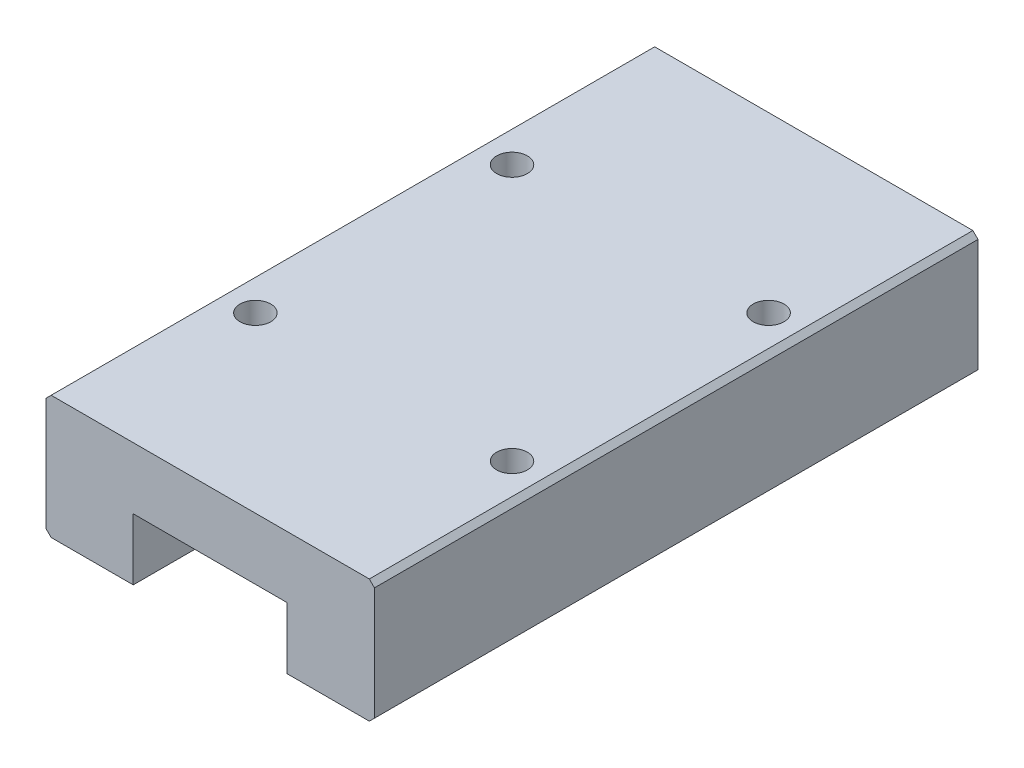
ISO-10303-21;
HEADER;
FILE_DESCRIPTION(('STEP AP214'),'2;1');
FILE_NAME('part.step','',(''),(''),'','','');
FILE_SCHEMA(('AUTOMOTIVE_DESIGN { 1 0 10303 214 1 1 1 1 }'));
ENDSEC;
DATA;
#1=APPLICATION_CONTEXT('core data for automotive mechanical design processes');
#2=APPLICATION_PROTOCOL_DEFINITION('international standard','automotive_design',2000,#1);
#3=PRODUCT_CONTEXT('',#1,'mechanical');
#4=PRODUCT('Part','Part','',(#3));
#5=PRODUCT_RELATED_PRODUCT_CATEGORY('part','',(#4));
#6=PRODUCT_DEFINITION_FORMATION('','',#4);
#7=PRODUCT_DEFINITION_CONTEXT('part definition',#1,'design');
#8=PRODUCT_DEFINITION('design','',#6,#7);
#9=PRODUCT_DEFINITION_SHAPE('','',#8);
#10=(LENGTH_UNIT() NAMED_UNIT(*) SI_UNIT(.MILLI.,.METRE.));
#11=(NAMED_UNIT(*) PLANE_ANGLE_UNIT() SI_UNIT($,.RADIAN.));
#12=(NAMED_UNIT(*) SI_UNIT($,.STERADIAN.) SOLID_ANGLE_UNIT());
#13=UNCERTAINTY_MEASURE_WITH_UNIT(LENGTH_MEASURE(1.E-05),#10,'distance_accuracy_value','');
#14=(GEOMETRIC_REPRESENTATION_CONTEXT(3) GLOBAL_UNCERTAINTY_ASSIGNED_CONTEXT((#13)) GLOBAL_UNIT_ASSIGNED_CONTEXT((#10,
#11,#12)) REPRESENTATION_CONTEXT('',''));
#15=CARTESIAN_POINT('',(0.,0.,0.));
#16=DIRECTION('',(0.,0.,1.));
#17=DIRECTION('',(1.,0.,0.));
#18=AXIS2_PLACEMENT_3D('',#15,#16,#17);
#19=CARTESIAN_POINT('',(-12.7323943661972,9.97887323943662,58.8));
#20=DIRECTION('',(0.707106781186547,-0.707106781186547,0.));
#21=DIRECTION('',(0.707106781186548,0.707106781186548,0.));
#22=AXIS2_PLACEMENT_3D('',#19,#20,#21);
#23=PLANE('',#22);
#24=DIRECTION('',(-0.707106781186547,-0.707106781186547,0.));
#25=VECTOR('',#24,1.);
#26=CARTESIAN_POINT('',(-12.7323943661972,9.97887323943662,0.));
#27=LINE('',#26,#25);
#28=CARTESIAN_POINT('',(-12.2323943661972,10.4788732394366,0.));
#29=VERTEX_POINT('',#28);
#30=CARTESIAN_POINT('',(-12.7323943661972,9.97887323943662,0.));
#31=VERTEX_POINT('',#30);
#32=EDGE_CURVE('E155',#29,#31,#27,.T.);
#33=ORIENTED_EDGE('',*,*,#32,.T.);
#34=DIRECTION('',(0.,0.,-1.));
#35=VECTOR('',#34,1.);
#36=CARTESIAN_POINT('',(-12.7323943661972,9.97887323943662,58.8));
#37=LINE('',#36,#35);
#38=CARTESIAN_POINT('',(-12.7323943661972,9.97887323943662,58.8));
#39=VERTEX_POINT('',#38);
#40=EDGE_CURVE('E11',#39,#31,#37,.T.);
#41=ORIENTED_EDGE('',*,*,#40,.F.);
#42=DIRECTION('',(-0.707106781186547,-0.707106781186547,0.));
#43=VECTOR('',#42,1.);
#44=CARTESIAN_POINT('',(-12.7323943661972,9.97887323943662,58.8));
#45=LINE('',#44,#43);
#46=CARTESIAN_POINT('',(-12.2323943661972,10.4788732394366,58.8));
#47=VERTEX_POINT('',#46);
#48=EDGE_CURVE('E178',#47,#39,#45,.T.);
#49=ORIENTED_EDGE('',*,*,#48,.F.);
#50=DIRECTION('',(0.,0.,-1.));
#51=VECTOR('',#50,1.);
#52=CARTESIAN_POINT('',(-12.2323943661972,10.4788732394366,58.8));
#53=LINE('',#52,#51);
#54=EDGE_CURVE('E151',#47,#29,#53,.T.);
#55=ORIENTED_EDGE('',*,*,#54,.T.);
#56=EDGE_LOOP('',(#33,#41,#49,#55));
#57=FACE_BOUND('',#56,.T.);
#58=ADVANCED_FACE('F35',(#57),#23,.F.);
#59=CARTESIAN_POINT('',(-12.7323943661972,9.97887323943662,58.8));
#60=DIRECTION('',(1.,0.,0.));
#61=DIRECTION('',(0.,1.,0.));
#62=AXIS2_PLACEMENT_3D('',#59,#60,#61);
#63=PLANE('',#62);
#64=DIRECTION('',(0.,-1.,0.));
#65=VECTOR('',#64,1.);
#66=CARTESIAN_POINT('',(-12.7323943661972,9.97887323943662,0.));
#67=LINE('',#66,#65);
#68=CARTESIAN_POINT('',(-12.7323943661972,-1.02112676056338,0.));
#69=VERTEX_POINT('',#68);
#70=EDGE_CURVE('E158',#31,#69,#67,.T.);
#71=ORIENTED_EDGE('',*,*,#70,.T.);
#72=DIRECTION('',(0.,0.,-1.));
#73=VECTOR('',#72,1.);
#74=CARTESIAN_POINT('',(-12.7323943661972,-1.02112676056338,58.8));
#75=LINE('',#74,#73);
#76=CARTESIAN_POINT('',(-12.7323943661972,-1.02112676056338,58.8));
#77=VERTEX_POINT('',#76);
#78=EDGE_CURVE('E43',#77,#69,#75,.T.);
#79=ORIENTED_EDGE('',*,*,#78,.F.);
#80=DIRECTION('',(0.,-1.,0.));
#81=VECTOR('',#80,1.);
#82=CARTESIAN_POINT('',(-12.7323943661972,9.97887323943662,58.8));
#83=LINE('',#82,#81);
#84=EDGE_CURVE('E106',#39,#77,#83,.T.);
#85=ORIENTED_EDGE('',*,*,#84,.F.);
#86=ORIENTED_EDGE('',*,*,#40,.T.);
#87=EDGE_LOOP('',(#71,#79,#85,#86));
#88=FACE_BOUND('',#87,.T.);
#89=ADVANCED_FACE('F259',(#88),#63,.F.);
#90=CARTESIAN_POINT('',(-12.7323943661972,-1.02112676056338,58.8));
#91=DIRECTION('',(0.707106781186547,0.707106781186548,0.));
#92=DIRECTION('',(-0.707106781186548,0.707106781186547,0.));
#93=AXIS2_PLACEMENT_3D('',#90,#91,#92);
#94=PLANE('',#93);
#95=DIRECTION('',(0.707106781186548,-0.707106781186547,0.));
#96=VECTOR('',#95,1.);
#97=CARTESIAN_POINT('',(-12.7323943661972,-1.02112676056338,0.));
#98=LINE('',#97,#96);
#99=CARTESIAN_POINT('',(-12.2323943661972,-1.52112676056338,0.));
#100=VERTEX_POINT('',#99);
#101=EDGE_CURVE('E161',#69,#100,#98,.T.);
#102=ORIENTED_EDGE('',*,*,#101,.T.);
#103=DIRECTION('',(0.,0.,-1.));
#104=VECTOR('',#103,1.);
#105=CARTESIAN_POINT('',(-12.2323943661972,-1.52112676056338,58.8));
#106=LINE('',#105,#104);
#107=CARTESIAN_POINT('',(-12.2323943661972,-1.52112676056338,58.8));
#108=VERTEX_POINT('',#107);
#109=EDGE_CURVE('E197',#108,#100,#106,.T.);
#110=ORIENTED_EDGE('',*,*,#109,.F.);
#111=DIRECTION('',(0.707106781186548,-0.707106781186547,0.));
#112=VECTOR('',#111,1.);
#113=CARTESIAN_POINT('',(-12.7323943661972,-1.02112676056338,58.8));
#114=LINE('',#113,#112);
#115=EDGE_CURVE('E205',#77,#108,#114,.T.);
#116=ORIENTED_EDGE('',*,*,#115,.F.);
#117=ORIENTED_EDGE('',*,*,#78,.T.);
#118=EDGE_LOOP('',(#102,#110,#116,#117));
#119=FACE_BOUND('',#118,.T.);
#120=ADVANCED_FACE('F203',(#119),#94,.F.);
#121=CARTESIAN_POINT('',(-12.2323943661972,-1.52112676056338,58.8));
#122=DIRECTION('',(0.,1.,0.));
#123=DIRECTION('',(0.,0.,1.));
#124=AXIS2_PLACEMENT_3D('',#121,#122,#123);
#125=PLANE('',#124);
#126=DIRECTION('',(1.,0.,0.));
#127=VECTOR('',#126,1.);
#128=CARTESIAN_POINT('',(-12.2323943661972,-1.52112676056338,0.));
#129=LINE('',#128,#127);
#130=CARTESIAN_POINT('',(-4.23239436619719,-1.52112676056338,0.));
#131=VERTEX_POINT('',#130);
#132=EDGE_CURVE('E163',#100,#131,#129,.T.);
#133=ORIENTED_EDGE('',*,*,#132,.T.);
#134=DIRECTION('',(0.,0.,-1.));
#135=VECTOR('',#134,1.);
#136=CARTESIAN_POINT('',(-4.23239436619719,-1.52112676056338,58.8));
#137=LINE('',#136,#135);
#138=CARTESIAN_POINT('',(-4.23239436619719,-1.52112676056338,58.8));
#139=VERTEX_POINT('',#138);
#140=EDGE_CURVE('E194',#139,#131,#137,.T.);
#141=ORIENTED_EDGE('',*,*,#140,.F.);
#142=DIRECTION('',(1.,0.,0.));
#143=VECTOR('',#142,1.);
#144=CARTESIAN_POINT('',(-12.2323943661972,-1.52112676056338,58.8));
#145=LINE('',#144,#143);
#146=EDGE_CURVE('E223',#108,#139,#145,.T.);
#147=ORIENTED_EDGE('',*,*,#146,.F.);
#148=ORIENTED_EDGE('',*,*,#109,.T.);
#149=EDGE_LOOP('',(#133,#141,#147,#148));
#150=FACE_BOUND('',#149,.T.);
#151=ADVANCED_FACE('F214',(#150),#125,.F.);
#152=CARTESIAN_POINT('',(-4.23239436619719,-1.52112676056338,58.8));
#153=DIRECTION('',(-1.,0.,0.));
#154=DIRECTION('',(0.,-1.,0.));
#155=AXIS2_PLACEMENT_3D('',#152,#153,#154);
#156=PLANE('',#155);
#157=DIRECTION('',(0.,1.,0.));
#158=VECTOR('',#157,1.);
#159=CARTESIAN_POINT('',(-4.23239436619719,-1.52112676056338,0.));
#160=LINE('',#159,#158);
#161=CARTESIAN_POINT('',(-4.23239436619719,4.47887323943662,0.));
#162=VERTEX_POINT('',#161);
#163=EDGE_CURVE('E165',#131,#162,#160,.T.);
#164=ORIENTED_EDGE('',*,*,#163,.T.);
#165=DIRECTION('',(0.,0.,-1.));
#166=VECTOR('',#165,1.);
#167=CARTESIAN_POINT('',(-4.23239436619719,4.47887323943662,58.8));
#168=LINE('',#167,#166);
#169=CARTESIAN_POINT('',(-4.23239436619719,4.47887323943662,58.8));
#170=VERTEX_POINT('',#169);
#171=EDGE_CURVE('E191',#170,#162,#168,.T.);
#172=ORIENTED_EDGE('',*,*,#171,.F.);
#173=DIRECTION('',(0.,1.,0.));
#174=VECTOR('',#173,1.);
#175=CARTESIAN_POINT('',(-4.23239436619719,-1.52112676056338,58.8));
#176=LINE('',#175,#174);
#177=EDGE_CURVE('E220',#139,#170,#176,.T.);
#178=ORIENTED_EDGE('',*,*,#177,.F.);
#179=ORIENTED_EDGE('',*,*,#140,.T.);
#180=EDGE_LOOP('',(#164,#172,#178,#179));
#181=FACE_BOUND('',#180,.T.);
#182=ADVANCED_FACE('F218',(#181),#156,.F.);
#183=CARTESIAN_POINT('',(-4.23239436619719,4.47887323943662,58.8));
#184=DIRECTION('',(0.,1.,0.));
#185=DIRECTION('',(-1.,0.,0.));
#186=AXIS2_PLACEMENT_3D('',#183,#184,#185);
#187=PLANE('',#186);
#188=DIRECTION('',(1.,0.,0.));
#189=VECTOR('',#188,1.);
#190=CARTESIAN_POINT('',(-4.23239436619719,4.47887323943662,0.));
#191=LINE('',#190,#189);
#192=CARTESIAN_POINT('',(10.7676056338028,4.47887323943662,0.));
#193=VERTEX_POINT('',#192);
#194=EDGE_CURVE('E167',#162,#193,#191,.T.);
#195=ORIENTED_EDGE('',*,*,#194,.T.);
#196=DIRECTION('',(0.,0.,-1.));
#197=VECTOR('',#196,1.);
#198=CARTESIAN_POINT('',(10.7676056338028,4.47887323943662,58.8));
#199=LINE('',#198,#197);
#200=CARTESIAN_POINT('',(10.7676056338028,4.47887323943662,58.8));
#201=VERTEX_POINT('',#200);
#202=EDGE_CURVE('E188',#201,#193,#199,.T.);
#203=ORIENTED_EDGE('',*,*,#202,.F.);
#204=DIRECTION('',(1.,0.,0.));
#205=VECTOR('',#204,1.);
#206=CARTESIAN_POINT('',(-4.23239436619719,4.47887323943662,58.8));
#207=LINE('',#206,#205);
#208=EDGE_CURVE('E222',#170,#201,#207,.T.);
#209=ORIENTED_EDGE('',*,*,#208,.F.);
#210=ORIENTED_EDGE('',*,*,#171,.T.);
#211=EDGE_LOOP('',(#195,#203,#209,#210));
#212=FACE_BOUND('',#211,.T.);
#213=ADVANCED_FACE('F272',(#212),#187,.F.);
#214=CARTESIAN_POINT('',(10.7676056338028,-1.52112676056338,58.8));
#215=DIRECTION('',(1.,0.,0.));
#216=DIRECTION('',(0.,1.,0.));
#217=AXIS2_PLACEMENT_3D('',#214,#215,#216);
#218=PLANE('',#217);
#219=DIRECTION('',(0.,-1.,0.));
#220=VECTOR('',#219,1.);
#221=CARTESIAN_POINT('',(10.7676056338028,-1.52112676056338,0.));
#222=LINE('',#221,#220);
#223=CARTESIAN_POINT('',(10.7676056338028,-1.52112676056338,0.));
#224=VERTEX_POINT('',#223);
#225=EDGE_CURVE('E169',#193,#224,#222,.T.);
#226=ORIENTED_EDGE('',*,*,#225,.T.);
#227=DIRECTION('',(0.,0.,-1.));
#228=VECTOR('',#227,1.);
#229=CARTESIAN_POINT('',(10.7676056338028,-1.52112676056338,58.8));
#230=LINE('',#229,#228);
#231=CARTESIAN_POINT('',(10.7676056338028,-1.52112676056338,58.8));
#232=VERTEX_POINT('',#231);
#233=EDGE_CURVE('E185',#232,#224,#230,.T.);
#234=ORIENTED_EDGE('',*,*,#233,.F.);
#235=DIRECTION('',(0.,-1.,0.));
#236=VECTOR('',#235,1.);
#237=CARTESIAN_POINT('',(10.7676056338028,-1.52112676056338,58.8));
#238=LINE('',#237,#236);
#239=EDGE_CURVE('E225',#201,#232,#238,.T.);
#240=ORIENTED_EDGE('',*,*,#239,.F.);
#241=ORIENTED_EDGE('',*,*,#202,.T.);
#242=EDGE_LOOP('',(#226,#234,#240,#241));
#243=FACE_BOUND('',#242,.T.);
#244=ADVANCED_FACE('F275',(#243),#218,.F.);
#245=CARTESIAN_POINT('',(10.7676056338028,-1.52112676056338,58.8));
#246=DIRECTION('',(0.,1.,0.));
#247=DIRECTION('',(0.,0.,1.));
#248=AXIS2_PLACEMENT_3D('',#245,#246,#247);
#249=PLANE('',#248);
#250=DIRECTION('',(1.,0.,0.));
#251=VECTOR('',#250,1.);
#252=CARTESIAN_POINT('',(10.7676056338028,-1.52112676056338,0.));
#253=LINE('',#252,#251);
#254=CARTESIAN_POINT('',(18.7676056338028,-1.52112676056338,0.));
#255=VERTEX_POINT('',#254);
#256=EDGE_CURVE('E171',#224,#255,#253,.T.);
#257=ORIENTED_EDGE('',*,*,#256,.T.);
#258=DIRECTION('',(0.,0.,-1.));
#259=VECTOR('',#258,1.);
#260=CARTESIAN_POINT('',(18.7676056338028,-1.52112676056338,58.8));
#261=LINE('',#260,#259);
#262=CARTESIAN_POINT('',(18.7676056338028,-1.52112676056338,58.8));
#263=VERTEX_POINT('',#262);
#264=EDGE_CURVE('E182',#263,#255,#261,.T.);
#265=ORIENTED_EDGE('',*,*,#264,.F.);
#266=DIRECTION('',(1.,0.,0.));
#267=VECTOR('',#266,1.);
#268=CARTESIAN_POINT('',(10.7676056338028,-1.52112676056338,58.8));
#269=LINE('',#268,#267);
#270=EDGE_CURVE('E231',#232,#263,#269,.T.);
#271=ORIENTED_EDGE('',*,*,#270,.F.);
#272=ORIENTED_EDGE('',*,*,#233,.T.);
#273=EDGE_LOOP('',(#257,#265,#271,#272));
#274=FACE_BOUND('',#273,.T.);
#275=ADVANCED_FACE('F237',(#274),#249,.F.);
#276=CARTESIAN_POINT('',(19.2676056338028,-1.02112676056338,58.8));
#277=DIRECTION('',(-0.707106781186547,0.707106781186548,0.));
#278=DIRECTION('',(-0.707106781186548,-0.707106781186547,0.));
#279=AXIS2_PLACEMENT_3D('',#276,#277,#278);
#280=PLANE('',#279);
#281=DIRECTION('',(0.707106781186548,0.707106781186547,0.));
#282=VECTOR('',#281,1.);
#283=CARTESIAN_POINT('',(19.2676056338028,-1.02112676056338,0.));
#284=LINE('',#283,#282);
#285=CARTESIAN_POINT('',(19.2676056338028,-1.02112676056338,0.));
#286=VERTEX_POINT('',#285);
#287=EDGE_CURVE('E173',#255,#286,#284,.T.);
#288=ORIENTED_EDGE('',*,*,#287,.T.);
#289=DIRECTION('',(0.,0.,-1.));
#290=VECTOR('',#289,1.);
#291=CARTESIAN_POINT('',(19.2676056338028,-1.02112676056338,58.8));
#292=LINE('',#291,#290);
#293=CARTESIAN_POINT('',(19.2676056338028,-1.02112676056338,58.8));
#294=VERTEX_POINT('',#293);
#295=EDGE_CURVE('E146',#294,#286,#292,.T.);
#296=ORIENTED_EDGE('',*,*,#295,.F.);
#297=DIRECTION('',(0.707106781186548,0.707106781186547,0.));
#298=VECTOR('',#297,1.);
#299=CARTESIAN_POINT('',(19.2676056338028,-1.02112676056338,58.8));
#300=LINE('',#299,#298);
#301=EDGE_CURVE('E137',#263,#294,#300,.T.);
#302=ORIENTED_EDGE('',*,*,#301,.F.);
#303=ORIENTED_EDGE('',*,*,#264,.T.);
#304=EDGE_LOOP('',(#288,#296,#302,#303));
#305=FACE_BOUND('',#304,.T.);
#306=ADVANCED_FACE('F241',(#305),#280,.F.);
#307=CARTESIAN_POINT('',(19.2676056338028,9.97887323943662,58.8));
#308=DIRECTION('',(-1.,0.,0.));
#309=DIRECTION('',(0.,-1.,0.));
#310=AXIS2_PLACEMENT_3D('',#307,#308,#309);
#311=PLANE('',#310);
#312=DIRECTION('',(0.,1.,0.));
#313=VECTOR('',#312,1.);
#314=CARTESIAN_POINT('',(19.2676056338028,9.97887323943662,0.));
#315=LINE('',#314,#313);
#316=CARTESIAN_POINT('',(19.2676056338028,9.97887323943662,0.));
#317=VERTEX_POINT('',#316);
#318=EDGE_CURVE('E145',#286,#317,#315,.T.);
#319=ORIENTED_EDGE('',*,*,#318,.T.);
#320=DIRECTION('',(0.,0.,-1.));
#321=VECTOR('',#320,1.);
#322=CARTESIAN_POINT('',(19.2676056338028,9.97887323943662,58.8));
#323=LINE('',#322,#321);
#324=CARTESIAN_POINT('',(19.2676056338028,9.97887323943662,58.8));
#325=VERTEX_POINT('',#324);
#326=EDGE_CURVE('E142',#325,#317,#323,.T.);
#327=ORIENTED_EDGE('',*,*,#326,.F.);
#328=DIRECTION('',(0.,1.,0.));
#329=VECTOR('',#328,1.);
#330=CARTESIAN_POINT('',(19.2676056338028,9.97887323943662,58.8));
#331=LINE('',#330,#329);
#332=EDGE_CURVE('E131',#294,#325,#331,.T.);
#333=ORIENTED_EDGE('',*,*,#332,.F.);
#334=ORIENTED_EDGE('',*,*,#295,.T.);
#335=EDGE_LOOP('',(#319,#327,#333,#334));
#336=FACE_BOUND('',#335,.T.);
#337=ADVANCED_FACE('F143',(#336),#311,.F.);
#338=CARTESIAN_POINT('',(18.7676056338028,10.4788732394366,58.8));
#339=DIRECTION('',(-0.707106781186547,-0.707106781186547,0.));
#340=DIRECTION('',(0.707106781186548,-0.707106781186548,0.));
#341=AXIS2_PLACEMENT_3D('',#338,#339,#340);
#342=PLANE('',#341);
#343=DIRECTION('',(-0.707106781186547,0.707106781186547,0.));
#344=VECTOR('',#343,1.);
#345=CARTESIAN_POINT('',(18.7676056338028,10.4788732394366,0.));
#346=LINE('',#345,#344);
#347=CARTESIAN_POINT('',(18.7676056338028,10.4788732394366,0.));
#348=VERTEX_POINT('',#347);
#349=EDGE_CURVE('E92',#317,#348,#346,.T.);
#350=ORIENTED_EDGE('',*,*,#349,.T.);
#351=DIRECTION('',(0.,0.,-1.));
#352=VECTOR('',#351,1.);
#353=CARTESIAN_POINT('',(18.7676056338028,10.4788732394366,58.8));
#354=LINE('',#353,#352);
#355=CARTESIAN_POINT('',(18.7676056338028,10.4788732394366,58.8));
#356=VERTEX_POINT('',#355);
#357=EDGE_CURVE('E147',#356,#348,#354,.T.);
#358=ORIENTED_EDGE('',*,*,#357,.F.);
#359=DIRECTION('',(-0.707106781186547,0.707106781186547,0.));
#360=VECTOR('',#359,1.);
#361=CARTESIAN_POINT('',(18.7676056338028,10.4788732394366,58.8));
#362=LINE('',#361,#360);
#363=EDGE_CURVE('E135',#325,#356,#362,.T.);
#364=ORIENTED_EDGE('',*,*,#363,.F.);
#365=ORIENTED_EDGE('',*,*,#326,.T.);
#366=EDGE_LOOP('',(#350,#358,#364,#365));
#367=FACE_BOUND('',#366,.T.);
#368=ADVANCED_FACE('F149',(#367),#342,.F.);
#369=CARTESIAN_POINT('',(-12.2323943661972,10.4788732394366,58.8));
#370=DIRECTION('',(0.,-1.,0.));
#371=DIRECTION('',(0.,0.,-1.));
#372=AXIS2_PLACEMENT_3D('',#369,#370,#371);
#373=PLANE('',#372);
#374=CARTESIAN_POINT('',(15.7676056338028,10.4788732394366,41.9));
#375=DIRECTION('',(0.,1.,0.));
#376=DIRECTION('',(0.,0.,1.));
#377=AXIS2_PLACEMENT_3D('',#374,#375,#376);
#378=CIRCLE('',#377,1.5);
#379=CARTESIAN_POINT('',(15.7676056338028,10.4788732394366,43.4));
#380=VERTEX_POINT('',#379);
#381=EDGE_CURVE('E398',#380,#380,#378,.T.);
#382=ORIENTED_EDGE('',*,*,#381,.F.);
#383=EDGE_LOOP('',(#382));
#384=FACE_BOUND('',#383,.T.);
#385=CARTESIAN_POINT('',(15.7676056338028,10.4788732394366,16.9));
#386=DIRECTION('',(0.,1.,0.));
#387=DIRECTION('',(0.,0.,1.));
#388=AXIS2_PLACEMENT_3D('',#385,#386,#387);
#389=CIRCLE('',#388,1.5);
#390=CARTESIAN_POINT('',(15.7676056338028,10.4788732394366,18.4));
#391=VERTEX_POINT('',#390);
#392=EDGE_CURVE('E397',#391,#391,#389,.T.);
#393=ORIENTED_EDGE('',*,*,#392,.F.);
#394=EDGE_LOOP('',(#393));
#395=FACE_BOUND('',#394,.T.);
#396=CARTESIAN_POINT('',(-9.23239436619719,10.4788732394366,16.9));
#397=DIRECTION('',(0.,1.,0.));
#398=DIRECTION('',(0.,0.,1.));
#399=AXIS2_PLACEMENT_3D('',#396,#397,#398);
#400=CIRCLE('',#399,1.5);
#401=CARTESIAN_POINT('',(-9.23239436619719,10.4788732394366,18.4));
#402=VERTEX_POINT('',#401);
#403=EDGE_CURVE('E417',#402,#402,#400,.T.);
#404=ORIENTED_EDGE('',*,*,#403,.F.);
#405=EDGE_LOOP('',(#404));
#406=FACE_BOUND('',#405,.T.);
#407=CARTESIAN_POINT('',(-9.23239436619719,10.4788732394366,41.9));
#408=DIRECTION('',(0.,1.,0.));
#409=DIRECTION('',(0.,0.,1.));
#410=AXIS2_PLACEMENT_3D('',#407,#408,#409);
#411=CIRCLE('',#410,1.5);
#412=CARTESIAN_POINT('',(-9.23239436619719,10.4788732394366,43.4));
#413=VERTEX_POINT('',#412);
#414=EDGE_CURVE('E409',#413,#413,#411,.T.);
#415=ORIENTED_EDGE('',*,*,#414,.F.);
#416=EDGE_LOOP('',(#415));
#417=FACE_BOUND('',#416,.T.);
#418=DIRECTION('',(-1.,0.,0.));
#419=VECTOR('',#418,1.);
#420=CARTESIAN_POINT('',(-12.2323943661972,10.4788732394366,0.));
#421=LINE('',#420,#419);
#422=EDGE_CURVE('E98',#348,#29,#421,.T.);
#423=ORIENTED_EDGE('',*,*,#422,.T.);
#424=ORIENTED_EDGE('',*,*,#54,.F.);
#425=DIRECTION('',(-1.,0.,0.));
#426=VECTOR('',#425,1.);
#427=CARTESIAN_POINT('',(-12.2323943661972,10.4788732394366,58.8));
#428=LINE('',#427,#426);
#429=EDGE_CURVE('E51',#356,#47,#428,.T.);
#430=ORIENTED_EDGE('',*,*,#429,.F.);
#431=ORIENTED_EDGE('',*,*,#357,.T.);
#432=EDGE_LOOP('',(#423,#424,#430,#431));
#433=FACE_BOUND('',#432,.T.);
#434=ADVANCED_FACE('F245',(#384,#395,#406,#417,#433),#373,.F.);
#435=CARTESIAN_POINT('',(0.,0.,58.8));
#436=DIRECTION('',(0.,0.,-1.));
#437=DIRECTION('',(-1.,0.,0.));
#438=AXIS2_PLACEMENT_3D('',#435,#436,#437);
#439=PLANE('',#438);
#440=ORIENTED_EDGE('',*,*,#48,.T.);
#441=ORIENTED_EDGE('',*,*,#84,.T.);
#442=ORIENTED_EDGE('',*,*,#115,.T.);
#443=ORIENTED_EDGE('',*,*,#146,.T.);
#444=ORIENTED_EDGE('',*,*,#177,.T.);
#445=ORIENTED_EDGE('',*,*,#208,.T.);
#446=ORIENTED_EDGE('',*,*,#239,.T.);
#447=ORIENTED_EDGE('',*,*,#270,.T.);
#448=ORIENTED_EDGE('',*,*,#301,.T.);
#449=ORIENTED_EDGE('',*,*,#332,.T.);
#450=ORIENTED_EDGE('',*,*,#363,.T.);
#451=ORIENTED_EDGE('',*,*,#429,.T.);
#452=EDGE_LOOP('',(#440,#441,#442,#443,#444,#445,#446,#447,#448,#449,#450,#451));
#453=FACE_BOUND('',#452,.T.);
#454=ADVANCED_FACE('F133',(#453),#439,.F.);
#455=CARTESIAN_POINT('',(0.,0.,0.));
#456=DIRECTION('',(0.,0.,-1.));
#457=DIRECTION('',(-1.,0.,0.));
#458=AXIS2_PLACEMENT_3D('',#455,#456,#457);
#459=PLANE('',#458);
#460=ORIENTED_EDGE('',*,*,#32,.F.);
#461=ORIENTED_EDGE('',*,*,#422,.F.);
#462=ORIENTED_EDGE('',*,*,#349,.F.);
#463=ORIENTED_EDGE('',*,*,#318,.F.);
#464=ORIENTED_EDGE('',*,*,#287,.F.);
#465=ORIENTED_EDGE('',*,*,#256,.F.);
#466=ORIENTED_EDGE('',*,*,#225,.F.);
#467=ORIENTED_EDGE('',*,*,#194,.F.);
#468=ORIENTED_EDGE('',*,*,#163,.F.);
#469=ORIENTED_EDGE('',*,*,#132,.F.);
#470=ORIENTED_EDGE('',*,*,#101,.F.);
#471=ORIENTED_EDGE('',*,*,#70,.F.);
#472=EDGE_LOOP('',(#460,#461,#462,#463,#464,#465,#466,#467,#468,#469,#470,#471));
#473=FACE_BOUND('',#472,.T.);
#474=ADVANCED_FACE('F209',(#473),#459,.T.);
#475=CARTESIAN_POINT('',(-9.23239436619719,6.47887323943662,41.9));
#476=DIRECTION('',(0.,1.,0.));
#477=DIRECTION('',(0.,0.,1.));
#478=AXIS2_PLACEMENT_3D('',#475,#476,#477);
#479=CYLINDRICAL_SURFACE('',#478,1.5);
#480=CARTESIAN_POINT('',(-9.23239436619719,6.47887323943662,41.9));
#481=DIRECTION('',(0.,1.,0.));
#482=DIRECTION('',(0.,0.,1.));
#483=AXIS2_PLACEMENT_3D('',#480,#481,#482);
#484=CIRCLE('',#483,1.5);
#485=CARTESIAN_POINT('',(-9.23239436619719,6.47887323943662,43.4));
#486=VERTEX_POINT('',#485);
#487=EDGE_CURVE('E159',#486,#486,#484,.T.);
#488=ORIENTED_EDGE('',*,*,#487,.F.);
#489=EDGE_LOOP('',(#488));
#490=FACE_BOUND('',#489,.T.);
#491=ORIENTED_EDGE('',*,*,#414,.T.);
#492=EDGE_LOOP('',(#491));
#493=FACE_BOUND('',#492,.T.);
#494=ADVANCED_FACE('F308',(#490,#493),#479,.F.);
#495=CARTESIAN_POINT('',(0.,6.47887323943662,0.));
#496=DIRECTION('',(0.,1.,0.));
#497=DIRECTION('',(0.,0.,1.));
#498=AXIS2_PLACEMENT_3D('',#495,#496,#497);
#499=PLANE('',#498);
#500=ORIENTED_EDGE('',*,*,#487,.T.);
#501=EDGE_LOOP('',(#500));
#502=FACE_BOUND('',#501,.T.);
#503=ADVANCED_FACE('F320',(#502),#499,.T.);
#504=CARTESIAN_POINT('',(-9.23239436619719,6.47887323943662,16.9));
#505=DIRECTION('',(0.,1.,0.));
#506=DIRECTION('',(0.,0.,1.));
#507=AXIS2_PLACEMENT_3D('',#504,#505,#506);
#508=CYLINDRICAL_SURFACE('',#507,1.5);
#509=CARTESIAN_POINT('',(-9.23239436619719,6.47887323943662,16.9));
#510=DIRECTION('',(0.,1.,0.));
#511=DIRECTION('',(0.,0.,1.));
#512=AXIS2_PLACEMENT_3D('',#509,#510,#511);
#513=CIRCLE('',#512,1.5);
#514=CARTESIAN_POINT('',(-9.23239436619719,6.47887323943662,18.4));
#515=VERTEX_POINT('',#514);
#516=EDGE_CURVE('E412',#515,#515,#513,.T.);
#517=ORIENTED_EDGE('',*,*,#516,.F.);
#518=EDGE_LOOP('',(#517));
#519=FACE_BOUND('',#518,.T.);
#520=ORIENTED_EDGE('',*,*,#403,.T.);
#521=EDGE_LOOP('',(#520));
#522=FACE_BOUND('',#521,.T.);
#523=ADVANCED_FACE('F330',(#519,#522),#508,.F.);
#524=CARTESIAN_POINT('',(0.,6.47887323943662,0.));
#525=DIRECTION('',(0.,1.,0.));
#526=DIRECTION('',(0.,0.,1.));
#527=AXIS2_PLACEMENT_3D('',#524,#525,#526);
#528=PLANE('',#527);
#529=ORIENTED_EDGE('',*,*,#516,.T.);
#530=EDGE_LOOP('',(#529));
#531=FACE_BOUND('',#530,.T.);
#532=ADVANCED_FACE('F340',(#531),#528,.T.);
#533=CARTESIAN_POINT('',(15.7676056338028,6.47887323943662,16.9));
#534=DIRECTION('',(0.,1.,0.));
#535=DIRECTION('',(0.,0.,1.));
#536=AXIS2_PLACEMENT_3D('',#533,#534,#535);
#537=CYLINDRICAL_SURFACE('',#536,1.5);
#538=CARTESIAN_POINT('',(15.7676056338028,6.47887323943662,16.9));
#539=DIRECTION('',(0.,1.,0.));
#540=DIRECTION('',(0.,0.,1.));
#541=AXIS2_PLACEMENT_3D('',#538,#539,#540);
#542=CIRCLE('',#541,1.5);
#543=CARTESIAN_POINT('',(15.7676056338028,6.47887323943662,18.4));
#544=VERTEX_POINT('',#543);
#545=EDGE_CURVE('E401',#544,#544,#542,.T.);
#546=ORIENTED_EDGE('',*,*,#545,.F.);
#547=EDGE_LOOP('',(#546));
#548=FACE_BOUND('',#547,.T.);
#549=ORIENTED_EDGE('',*,*,#392,.T.);
#550=EDGE_LOOP('',(#549));
#551=FACE_BOUND('',#550,.T.);
#552=ADVANCED_FACE('F350',(#548,#551),#537,.F.);
#553=CARTESIAN_POINT('',(0.,6.47887323943662,0.));
#554=DIRECTION('',(0.,1.,0.));
#555=DIRECTION('',(0.,0.,1.));
#556=AXIS2_PLACEMENT_3D('',#553,#554,#555);
#557=PLANE('',#556);
#558=ORIENTED_EDGE('',*,*,#545,.T.);
#559=EDGE_LOOP('',(#558));
#560=FACE_BOUND('',#559,.T.);
#561=ADVANCED_FACE('F360',(#560),#557,.T.);
#562=CARTESIAN_POINT('',(15.7676056338028,6.47887323943662,41.9));
#563=DIRECTION('',(0.,1.,0.));
#564=DIRECTION('',(0.,0.,1.));
#565=AXIS2_PLACEMENT_3D('',#562,#563,#564);
#566=CYLINDRICAL_SURFACE('',#565,1.5);
#567=CARTESIAN_POINT('',(15.7676056338028,6.47887323943662,41.9));
#568=DIRECTION('',(0.,1.,0.));
#569=DIRECTION('',(0.,0.,1.));
#570=AXIS2_PLACEMENT_3D('',#567,#568,#569);
#571=CIRCLE('',#570,1.5);
#572=CARTESIAN_POINT('',(15.7676056338028,6.47887323943662,43.4));
#573=VERTEX_POINT('',#572);
#574=EDGE_CURVE('E396',#573,#573,#571,.T.);
#575=ORIENTED_EDGE('',*,*,#574,.F.);
#576=EDGE_LOOP('',(#575));
#577=FACE_BOUND('',#576,.T.);
#578=ORIENTED_EDGE('',*,*,#381,.T.);
#579=EDGE_LOOP('',(#578));
#580=FACE_BOUND('',#579,.T.);
#581=ADVANCED_FACE('F370',(#577,#580),#566,.F.);
#582=CARTESIAN_POINT('',(0.,6.47887323943662,0.));
#583=DIRECTION('',(0.,1.,0.));
#584=DIRECTION('',(0.,0.,1.));
#585=AXIS2_PLACEMENT_3D('',#582,#583,#584);
#586=PLANE('',#585);
#587=ORIENTED_EDGE('',*,*,#574,.T.);
#588=EDGE_LOOP('',(#587));
#589=FACE_BOUND('',#588,.T.);
#590=ADVANCED_FACE('F380',(#589),#586,.T.);
#591=CLOSED_SHELL('',(#58,#89,#120,#151,#182,#213,#244,#275,#306,#337,#368,#434,#454,#474,#494,
#503,#523,#532,#552,#561,#581,#590));
#592=MANIFOLD_SOLID_BREP('B2',#591);
#593=ADVANCED_BREP_SHAPE_REPRESENTATION('',(#18,#592),#14);
#594=SHAPE_DEFINITION_REPRESENTATION(#9,#593);
ENDSEC;
END-ISO-10303-21;
